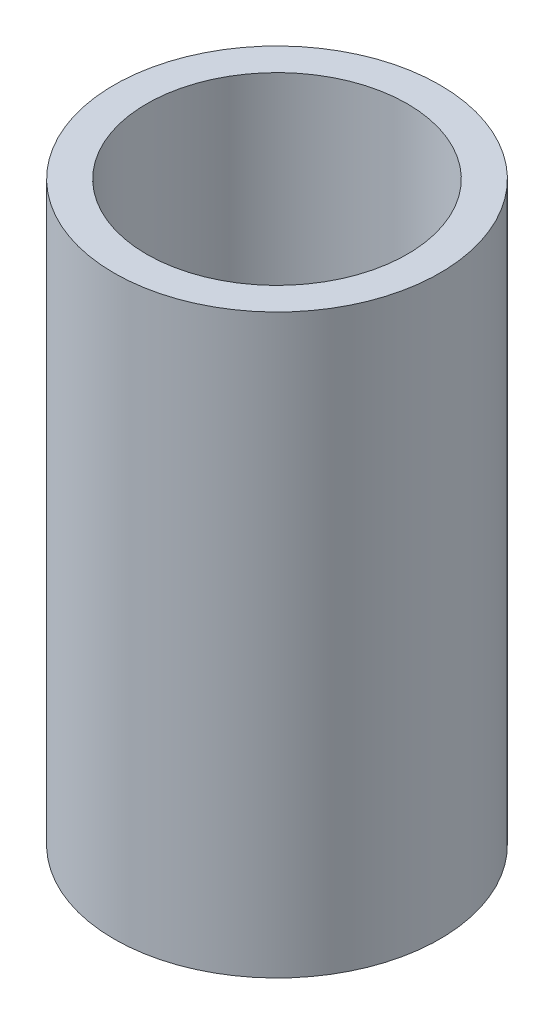
ISO-10303-21;
HEADER;
FILE_DESCRIPTION(('STEP AP214'),'2;1');
FILE_NAME('part.step','',(''),(''),'','','');
FILE_SCHEMA(('AUTOMOTIVE_DESIGN { 1 0 10303 214 1 1 1 1 }'));
ENDSEC;
DATA;
#1=APPLICATION_CONTEXT('core data for automotive mechanical design processes');
#2=APPLICATION_PROTOCOL_DEFINITION('international standard','automotive_design',2000,#1);
#3=PRODUCT_CONTEXT('',#1,'mechanical');
#4=PRODUCT('Part','Part','',(#3));
#5=PRODUCT_RELATED_PRODUCT_CATEGORY('part','',(#4));
#6=PRODUCT_DEFINITION_FORMATION('','',#4);
#7=PRODUCT_DEFINITION_CONTEXT('part definition',#1,'design');
#8=PRODUCT_DEFINITION('design','',#6,#7);
#9=PRODUCT_DEFINITION_SHAPE('','',#8);
#10=(LENGTH_UNIT() NAMED_UNIT(*) SI_UNIT(.MILLI.,.METRE.));
#11=(NAMED_UNIT(*) PLANE_ANGLE_UNIT() SI_UNIT($,.RADIAN.));
#12=(NAMED_UNIT(*) SI_UNIT($,.STERADIAN.) SOLID_ANGLE_UNIT());
#13=UNCERTAINTY_MEASURE_WITH_UNIT(LENGTH_MEASURE(1.E-05),#10,'distance_accuracy_value','');
#14=(GEOMETRIC_REPRESENTATION_CONTEXT(3) GLOBAL_UNCERTAINTY_ASSIGNED_CONTEXT((#13)) GLOBAL_UNIT_ASSIGNED_CONTEXT((#10,
#11,#12)) REPRESENTATION_CONTEXT('',''));
#15=CARTESIAN_POINT('',(0.,0.,0.));
#16=DIRECTION('',(0.,0.,1.));
#17=DIRECTION('',(1.,0.,0.));
#18=AXIS2_PLACEMENT_3D('',#15,#16,#17);
#19=CARTESIAN_POINT('',(0.,17.7,0.));
#20=DIRECTION('',(0.,1.,0.));
#21=DIRECTION('',(0.,0.,1.));
#22=AXIS2_PLACEMENT_3D('',#19,#20,#21);
#23=PLANE('',#22);
#24=CARTESIAN_POINT('',(0.,17.7,0.));
#25=DIRECTION('',(0.,1.,0.));
#26=DIRECTION('',(0.,0.,1.));
#27=AXIS2_PLACEMENT_3D('',#24,#25,#26);
#28=CIRCLE('',#27,5.);
#29=CARTESIAN_POINT('',(0.,17.7,5.));
#30=VERTEX_POINT('',#29);
#31=EDGE_CURVE('E10',#30,#30,#28,.T.);
#32=ORIENTED_EDGE('',*,*,#31,.T.);
#33=EDGE_LOOP('',(#32));
#34=FACE_BOUND('',#33,.T.);
#35=CARTESIAN_POINT('',(0.,17.7,0.));
#36=DIRECTION('',(0.,1.,0.));
#37=DIRECTION('',(0.,0.,1.));
#38=AXIS2_PLACEMENT_3D('',#35,#36,#37);
#39=CIRCLE('',#38,4.);
#40=CARTESIAN_POINT('',(0.,17.7,4.));
#41=VERTEX_POINT('',#40);
#42=EDGE_CURVE('E44',#41,#41,#39,.T.);
#43=ORIENTED_EDGE('',*,*,#42,.F.);
#44=EDGE_LOOP('',(#43));
#45=FACE_BOUND('',#44,.T.);
#46=ADVANCED_FACE('F33',(#34,#45),#23,.T.);
#47=CARTESIAN_POINT('',(0.,0.,0.));
#48=DIRECTION('',(0.,1.,0.));
#49=DIRECTION('',(0.,0.,1.));
#50=AXIS2_PLACEMENT_3D('',#47,#48,#49);
#51=PLANE('',#50);
#52=CARTESIAN_POINT('',(0.,0.,0.));
#53=DIRECTION('',(0.,1.,0.));
#54=DIRECTION('',(0.,0.,1.));
#55=AXIS2_PLACEMENT_3D('',#52,#53,#54);
#56=CIRCLE('',#55,5.);
#57=CARTESIAN_POINT('',(0.,0.,5.));
#58=VERTEX_POINT('',#57);
#59=EDGE_CURVE('E37',#58,#58,#56,.T.);
#60=ORIENTED_EDGE('',*,*,#59,.F.);
#61=EDGE_LOOP('',(#60));
#62=FACE_BOUND('',#61,.T.);
#63=CARTESIAN_POINT('',(0.,0.,0.));
#64=DIRECTION('',(0.,1.,0.));
#65=DIRECTION('',(0.,0.,1.));
#66=AXIS2_PLACEMENT_3D('',#63,#64,#65);
#67=CIRCLE('',#66,4.);
#68=CARTESIAN_POINT('',(0.,0.,4.));
#69=VERTEX_POINT('',#68);
#70=EDGE_CURVE('E46',#69,#69,#67,.T.);
#71=ORIENTED_EDGE('',*,*,#70,.T.);
#72=EDGE_LOOP('',(#71));
#73=FACE_BOUND('',#72,.T.);
#74=ADVANCED_FACE('F56',(#62,#73),#51,.F.);
#75=CARTESIAN_POINT('',(0.,17.7,0.));
#76=DIRECTION('',(0.,-1.,0.));
#77=DIRECTION('',(0.,0.,-1.));
#78=AXIS2_PLACEMENT_3D('',#75,#76,#77);
#79=CYLINDRICAL_SURFACE('',#78,5.);
#80=ORIENTED_EDGE('',*,*,#31,.F.);
#81=EDGE_LOOP('',(#80));
#82=FACE_BOUND('',#81,.T.);
#83=ORIENTED_EDGE('',*,*,#59,.T.);
#84=EDGE_LOOP('',(#83));
#85=FACE_BOUND('',#84,.T.);
#86=ADVANCED_FACE('F35',(#82,#85),#79,.T.);
#87=CARTESIAN_POINT('',(0.,17.7,0.));
#88=DIRECTION('',(0.,-1.,0.));
#89=DIRECTION('',(0.,0.,-1.));
#90=AXIS2_PLACEMENT_3D('',#87,#88,#89);
#91=CYLINDRICAL_SURFACE('',#90,4.);
#92=ORIENTED_EDGE('',*,*,#42,.T.);
#93=EDGE_LOOP('',(#92));
#94=FACE_BOUND('',#93,.T.);
#95=ORIENTED_EDGE('',*,*,#70,.F.);
#96=EDGE_LOOP('',(#95));
#97=FACE_BOUND('',#96,.T.);
#98=ADVANCED_FACE('F52',(#94,#97),#91,.F.);
#99=CLOSED_SHELL('',(#46,#74,#86,#98));
#100=MANIFOLD_SOLID_BREP('B2',#99);
#101=ADVANCED_BREP_SHAPE_REPRESENTATION('',(#18,#100),#14);
#102=SHAPE_DEFINITION_REPRESENTATION(#9,#101);
ENDSEC;
END-ISO-10303-21;
